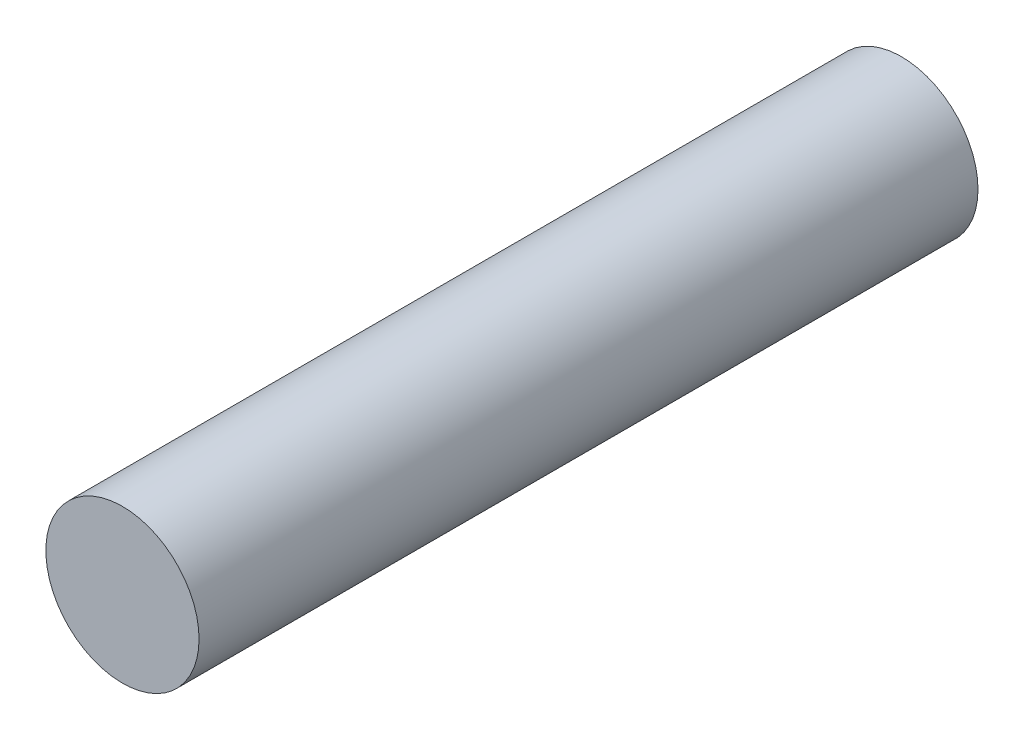
ISO-10303-21;
HEADER;
FILE_DESCRIPTION(('STEP AP214'),'2;1');
FILE_NAME('part.step','',(''),(''),'','','');
FILE_SCHEMA(('AUTOMOTIVE_DESIGN { 1 0 10303 214 1 1 1 1 }'));
ENDSEC;
DATA;
#1=APPLICATION_CONTEXT('core data for automotive mechanical design processes');
#2=APPLICATION_PROTOCOL_DEFINITION('international standard','automotive_design',2000,#1);
#3=PRODUCT_CONTEXT('',#1,'mechanical');
#4=PRODUCT('Part','Part','',(#3));
#5=PRODUCT_RELATED_PRODUCT_CATEGORY('part','',(#4));
#6=PRODUCT_DEFINITION_FORMATION('','',#4);
#7=PRODUCT_DEFINITION_CONTEXT('part definition',#1,'design');
#8=PRODUCT_DEFINITION('design','',#6,#7);
#9=PRODUCT_DEFINITION_SHAPE('','',#8);
#10=(LENGTH_UNIT() NAMED_UNIT(*) SI_UNIT(.MILLI.,.METRE.));
#11=(NAMED_UNIT(*) PLANE_ANGLE_UNIT() SI_UNIT($,.RADIAN.));
#12=(NAMED_UNIT(*) SI_UNIT($,.STERADIAN.) SOLID_ANGLE_UNIT());
#13=UNCERTAINTY_MEASURE_WITH_UNIT(LENGTH_MEASURE(1.E-05),#10,'distance_accuracy_value','');
#14=(GEOMETRIC_REPRESENTATION_CONTEXT(3) GLOBAL_UNCERTAINTY_ASSIGNED_CONTEXT((#13)) GLOBAL_UNIT_ASSIGNED_CONTEXT((#10,
#11,#12)) REPRESENTATION_CONTEXT('',''));
#15=CARTESIAN_POINT('',(0.,0.,0.));
#16=DIRECTION('',(0.,0.,1.));
#17=DIRECTION('',(1.,0.,0.));
#18=AXIS2_PLACEMENT_3D('',#15,#16,#17);
#19=CARTESIAN_POINT('',(0.,0.,30.));
#20=DIRECTION('',(0.,0.,-1.));
#21=DIRECTION('',(-1.,0.,0.));
#22=AXIS2_PLACEMENT_3D('',#19,#20,#21);
#23=CYLINDRICAL_SURFACE('',#22,2.95);
#24=CARTESIAN_POINT('',(0.,0.,30.));
#25=DIRECTION('',(0.,0.,1.));
#26=DIRECTION('',(1.,0.,0.));
#27=AXIS2_PLACEMENT_3D('',#24,#25,#26);
#28=CIRCLE('',#27,2.95);
#29=CARTESIAN_POINT('',(2.95,0.,30.));
#30=VERTEX_POINT('',#29);
#31=EDGE_CURVE('E11',#30,#30,#28,.T.);
#32=ORIENTED_EDGE('',*,*,#31,.F.);
#33=EDGE_LOOP('',(#32));
#34=FACE_BOUND('',#33,.T.);
#35=CARTESIAN_POINT('',(0.,0.,0.));
#36=DIRECTION('',(0.,0.,1.));
#37=DIRECTION('',(1.,0.,0.));
#38=AXIS2_PLACEMENT_3D('',#35,#36,#37);
#39=CIRCLE('',#38,2.95);
#40=CARTESIAN_POINT('',(2.95,0.,0.));
#41=VERTEX_POINT('',#40);
#42=EDGE_CURVE('E36',#41,#41,#39,.T.);
#43=ORIENTED_EDGE('',*,*,#42,.T.);
#44=EDGE_LOOP('',(#43));
#45=FACE_BOUND('',#44,.T.);
#46=ADVANCED_FACE('F33',(#34,#45),#23,.T.);
#47=CARTESIAN_POINT('',(0.,0.,30.));
#48=DIRECTION('',(0.,0.,1.));
#49=DIRECTION('',(1.,0.,0.));
#50=AXIS2_PLACEMENT_3D('',#47,#48,#49);
#51=PLANE('',#50);
#52=ORIENTED_EDGE('',*,*,#31,.T.);
#53=EDGE_LOOP('',(#52));
#54=FACE_BOUND('',#53,.T.);
#55=ADVANCED_FACE('F86',(#54),#51,.T.);
#56=CARTESIAN_POINT('',(0.,0.,0.));
#57=DIRECTION('',(0.,0.,1.));
#58=DIRECTION('',(1.,0.,0.));
#59=AXIS2_PLACEMENT_3D('',#56,#57,#58);
#60=PLANE('',#59);
#61=DIRECTION('',(1.,0.,0.));
#62=VECTOR('',#61,1.);
#63=CARTESIAN_POINT('',(1.61939737354294,1.4,0.));
#64=LINE('',#63,#62);
#65=CARTESIAN_POINT('',(-1.61939737354294,1.4,0.));
#66=VERTEX_POINT('',#65);
#67=CARTESIAN_POINT('',(1.61939737354294,1.4,0.));
#68=VERTEX_POINT('',#67);
#69=EDGE_CURVE('E66',#66,#68,#64,.T.);
#70=ORIENTED_EDGE('',*,*,#69,.F.);
#71=CARTESIAN_POINT('',(0.,0.,0.));
#72=DIRECTION('',(0.,0.,-1.));
#73=DIRECTION('',(-1.,0.,0.));
#74=AXIS2_PLACEMENT_3D('',#71,#72,#73);
#75=CIRCLE('',#74,2.14066528290571);
#76=EDGE_CURVE('E47',#68,#66,#75,.T.);
#77=ORIENTED_EDGE('',*,*,#76,.F.);
#78=EDGE_LOOP('',(#70,#77));
#79=FACE_BOUND('',#78,.T.);
#80=ORIENTED_EDGE('',*,*,#42,.F.);
#81=EDGE_LOOP('',(#80));
#82=FACE_BOUND('',#81,.T.);
#83=ADVANCED_FACE('F70',(#79,#82),#60,.F.);
#84=CARTESIAN_POINT('',(0.,0.,7.));
#85=DIRECTION('',(0.,0.,-1.));
#86=DIRECTION('',(-1.,0.,0.));
#87=AXIS2_PLACEMENT_3D('',#84,#85,#86);
#88=CYLINDRICAL_SURFACE('',#87,2.14066528290571);
#89=ORIENTED_EDGE('',*,*,#76,.T.);
#90=DIRECTION('',(0.,0.,-1.));
#91=VECTOR('',#90,1.);
#92=CARTESIAN_POINT('',(-1.61939737354294,1.4,7.));
#93=LINE('',#92,#91);
#94=CARTESIAN_POINT('',(-1.61939737354294,1.4,7.));
#95=VERTEX_POINT('',#94);
#96=EDGE_CURVE('E63',#95,#66,#93,.T.);
#97=ORIENTED_EDGE('',*,*,#96,.F.);
#98=CARTESIAN_POINT('',(0.,0.,7.));
#99=DIRECTION('',(0.,0.,-1.));
#100=DIRECTION('',(-1.,0.,0.));
#101=AXIS2_PLACEMENT_3D('',#98,#99,#100);
#102=CIRCLE('',#101,2.14066528290571);
#103=CARTESIAN_POINT('',(1.61939737354294,1.4,7.));
#104=VERTEX_POINT('',#103);
#105=EDGE_CURVE('E61',#104,#95,#102,.T.);
#106=ORIENTED_EDGE('',*,*,#105,.F.);
#107=DIRECTION('',(0.,0.,-1.));
#108=VECTOR('',#107,1.);
#109=CARTESIAN_POINT('',(1.61939737354294,1.4,7.));
#110=LINE('',#109,#108);
#111=EDGE_CURVE('E55',#104,#68,#110,.T.);
#112=ORIENTED_EDGE('',*,*,#111,.T.);
#113=EDGE_LOOP('',(#89,#97,#106,#112));
#114=FACE_BOUND('',#113,.T.);
#115=ADVANCED_FACE('F59',(#114),#88,.F.);
#116=CARTESIAN_POINT('',(1.61939737354294,1.4,7.));
#117=DIRECTION('',(0.,1.,0.));
#118=DIRECTION('',(0.,0.,1.));
#119=AXIS2_PLACEMENT_3D('',#116,#117,#118);
#120=PLANE('',#119);
#121=ORIENTED_EDGE('',*,*,#69,.T.);
#122=ORIENTED_EDGE('',*,*,#111,.F.);
#123=DIRECTION('',(1.,0.,0.));
#124=VECTOR('',#123,1.);
#125=CARTESIAN_POINT('',(1.61939737354294,1.4,7.));
#126=LINE('',#125,#124);
#127=EDGE_CURVE('E74',#95,#104,#126,.T.);
#128=ORIENTED_EDGE('',*,*,#127,.F.);
#129=ORIENTED_EDGE('',*,*,#96,.T.);
#130=EDGE_LOOP('',(#121,#122,#128,#129));
#131=FACE_BOUND('',#130,.T.);
#132=ADVANCED_FACE('F67',(#131),#120,.F.);
#133=CARTESIAN_POINT('',(0.,0.,7.));
#134=DIRECTION('',(0.,0.,-1.));
#135=DIRECTION('',(-1.,0.,0.));
#136=AXIS2_PLACEMENT_3D('',#133,#134,#135);
#137=PLANE('',#136);
#138=ORIENTED_EDGE('',*,*,#105,.T.);
#139=ORIENTED_EDGE('',*,*,#127,.T.);
#140=EDGE_LOOP('',(#138,#139));
#141=FACE_BOUND('',#140,.T.);
#142=ADVANCED_FACE('F78',(#141),#137,.T.);
#143=CLOSED_SHELL('',(#46,#55,#83,#115,#132,#142));
#144=MANIFOLD_SOLID_BREP('B2',#143);
#145=ADVANCED_BREP_SHAPE_REPRESENTATION('',(#18,#144),#14);
#146=SHAPE_DEFINITION_REPRESENTATION(#9,#145);
ENDSEC;
END-ISO-10303-21;
